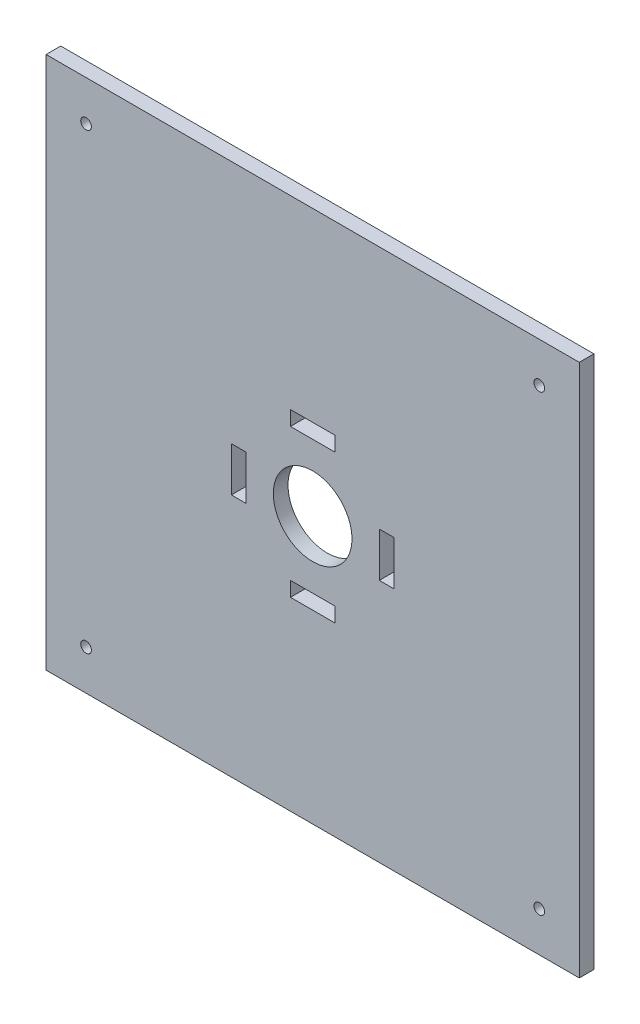
ISO-10303-21;
HEADER;
FILE_DESCRIPTION(('STEP AP214'),'2;1');
FILE_NAME('part.step','',(''),(''),'','','');
FILE_SCHEMA(('AUTOMOTIVE_DESIGN { 1 0 10303 214 1 1 1 1 }'));
ENDSEC;
DATA;
#1=APPLICATION_CONTEXT('core data for automotive mechanical design processes');
#2=APPLICATION_PROTOCOL_DEFINITION('international standard','automotive_design',2000,#1);
#3=PRODUCT_CONTEXT('',#1,'mechanical');
#4=PRODUCT('Part','Part','',(#3));
#5=PRODUCT_RELATED_PRODUCT_CATEGORY('part','',(#4));
#6=PRODUCT_DEFINITION_FORMATION('','',#4);
#7=PRODUCT_DEFINITION_CONTEXT('part definition',#1,'design');
#8=PRODUCT_DEFINITION('design','',#6,#7);
#9=PRODUCT_DEFINITION_SHAPE('','',#8);
#10=(LENGTH_UNIT() NAMED_UNIT(*) SI_UNIT(.MILLI.,.METRE.));
#11=(NAMED_UNIT(*) PLANE_ANGLE_UNIT() SI_UNIT($,.RADIAN.));
#12=(NAMED_UNIT(*) SI_UNIT($,.STERADIAN.) SOLID_ANGLE_UNIT());
#13=UNCERTAINTY_MEASURE_WITH_UNIT(LENGTH_MEASURE(1.E-05),#10,'distance_accuracy_value','');
#14=(GEOMETRIC_REPRESENTATION_CONTEXT(3) GLOBAL_UNCERTAINTY_ASSIGNED_CONTEXT((#13)) GLOBAL_UNIT_ASSIGNED_CONTEXT((#10,
#11,#12)) REPRESENTATION_CONTEXT('',''));
#15=CARTESIAN_POINT('',(0.,0.,0.));
#16=DIRECTION('',(0.,0.,1.));
#17=DIRECTION('',(1.,0.,0.));
#18=AXIS2_PLACEMENT_3D('',#15,#16,#17);
#19=CARTESIAN_POINT('',(0.,200.,5.5));
#20=DIRECTION('',(0.,0.,-1.));
#21=DIRECTION('',(-1.,0.,0.));
#22=AXIS2_PLACEMENT_3D('',#19,#20,#21);
#23=PLANE('',#22);
#24=DIRECTION('',(0.,-1.,0.));
#25=VECTOR('',#24,1.);
#26=CARTESIAN_POINT('',(69.5,91.6666666666667,5.5));
#27=LINE('',#26,#25);
#28=CARTESIAN_POINT('',(69.5,108.333333333333,5.49999999999999));
#29=VERTEX_POINT('',#28);
#30=CARTESIAN_POINT('',(69.5,91.6666666666667,5.5));
#31=VERTEX_POINT('',#30);
#32=EDGE_CURVE('E238',#29,#31,#27,.T.);
#33=ORIENTED_EDGE('',*,*,#32,.F.);
#34=DIRECTION('',(-1.,0.,0.));
#35=VECTOR('',#34,1.);
#36=CARTESIAN_POINT('',(75.,108.333333333333,5.49999999999999));
#37=LINE('',#36,#35);
#38=CARTESIAN_POINT('',(75.,108.333333333333,5.49999999999999));
#39=VERTEX_POINT('',#38);
#40=EDGE_CURVE('E246',#39,#29,#37,.T.);
#41=ORIENTED_EDGE('',*,*,#40,.F.);
#42=DIRECTION('',(0.,-1.,0.));
#43=VECTOR('',#42,1.);
#44=CARTESIAN_POINT('',(75.,91.6666666666667,5.5));
#45=LINE('',#44,#43);
#46=CARTESIAN_POINT('',(75.,91.6666666666667,5.5));
#47=VERTEX_POINT('',#46);
#48=EDGE_CURVE('E231',#39,#47,#45,.T.);
#49=ORIENTED_EDGE('',*,*,#48,.T.);
#50=DIRECTION('',(-1.,0.,0.));
#51=VECTOR('',#50,1.);
#52=CARTESIAN_POINT('',(75.,91.6666666666667,5.5));
#53=LINE('',#52,#51);
#54=EDGE_CURVE('E243',#47,#31,#53,.T.);
#55=ORIENTED_EDGE('',*,*,#54,.T.);
#56=EDGE_LOOP('',(#33,#41,#49,#55));
#57=FACE_BOUND('',#56,.T.);
#58=DIRECTION('',(-1.,0.,0.));
#59=VECTOR('',#58,1.);
#60=CARTESIAN_POINT('',(91.6666666666667,130.5,5.50000000000001));
#61=LINE('',#60,#59);
#62=CARTESIAN_POINT('',(108.333333333333,130.5,5.50000000000001));
#63=VERTEX_POINT('',#62);
#64=CARTESIAN_POINT('',(91.6666666666667,130.5,5.50000000000001));
#65=VERTEX_POINT('',#64);
#66=EDGE_CURVE('E194',#63,#65,#61,.T.);
#67=ORIENTED_EDGE('',*,*,#66,.F.);
#68=DIRECTION('',(0.,1.,0.));
#69=VECTOR('',#68,1.);
#70=CARTESIAN_POINT('',(108.333333333333,125.,5.50000000000001));
#71=LINE('',#70,#69);
#72=CARTESIAN_POINT('',(108.333333333333,125.,5.50000000000001));
#73=VERTEX_POINT('',#72);
#74=EDGE_CURVE('E176',#73,#63,#71,.T.);
#75=ORIENTED_EDGE('',*,*,#74,.F.);
#76=DIRECTION('',(-1.,0.,0.));
#77=VECTOR('',#76,1.);
#78=CARTESIAN_POINT('',(91.6666666666667,125.,5.50000000000001));
#79=LINE('',#78,#77);
#80=CARTESIAN_POINT('',(91.6666666666667,125.,5.5));
#81=VERTEX_POINT('',#80);
#82=EDGE_CURVE('E182',#73,#81,#79,.T.);
#83=ORIENTED_EDGE('',*,*,#82,.T.);
#84=DIRECTION('',(0.,1.,0.));
#85=VECTOR('',#84,1.);
#86=CARTESIAN_POINT('',(91.6666666666667,125.,5.50000000000001));
#87=LINE('',#86,#85);
#88=EDGE_CURVE('E195',#81,#65,#87,.T.);
#89=ORIENTED_EDGE('',*,*,#88,.T.);
#90=EDGE_LOOP('',(#67,#75,#83,#89));
#91=FACE_BOUND('',#90,.T.);
#92=CARTESIAN_POINT('',(14.9999999999991,184.999999999999,5.5));
#93=DIRECTION('',(0.,0.,-1.));
#94=DIRECTION('',(-1.,0.,0.));
#95=AXIS2_PLACEMENT_3D('',#92,#93,#94);
#96=CIRCLE('',#95,2.00000000000002);
#97=CARTESIAN_POINT('',(12.9999999999991,184.999999999999,5.5));
#98=VERTEX_POINT('',#97);
#99=EDGE_CURVE('E277',#98,#98,#96,.T.);
#100=ORIENTED_EDGE('',*,*,#99,.T.);
#101=EDGE_LOOP('',(#100));
#102=FACE_BOUND('',#101,.T.);
#103=CARTESIAN_POINT('',(184.999999999999,185.000000000001,5.5));
#104=DIRECTION('',(0.,0.,-1.));
#105=DIRECTION('',(-1.,0.,0.));
#106=AXIS2_PLACEMENT_3D('',#103,#104,#105);
#107=CIRCLE('',#106,2.00000000000002);
#108=CARTESIAN_POINT('',(182.999999999999,185.000000000001,5.5));
#109=VERTEX_POINT('',#108);
#110=EDGE_CURVE('E283',#109,#109,#107,.T.);
#111=ORIENTED_EDGE('',*,*,#110,.T.);
#112=EDGE_LOOP('',(#111));
#113=FACE_BOUND('',#112,.T.);
#114=CARTESIAN_POINT('',(185.,15.0000000000003,5.5));
#115=DIRECTION('',(0.,0.,-1.));
#116=DIRECTION('',(-1.,0.,0.));
#117=AXIS2_PLACEMENT_3D('',#114,#115,#116);
#118=CIRCLE('',#117,2.);
#119=CARTESIAN_POINT('',(183.,15.0000000000003,5.5));
#120=VERTEX_POINT('',#119);
#121=EDGE_CURVE('E289',#120,#120,#118,.T.);
#122=ORIENTED_EDGE('',*,*,#121,.T.);
#123=EDGE_LOOP('',(#122));
#124=FACE_BOUND('',#123,.T.);
#125=CARTESIAN_POINT('',(15.,15.,5.5));
#126=DIRECTION('',(0.,0.,-1.));
#127=DIRECTION('',(-1.,0.,0.));
#128=AXIS2_PLACEMENT_3D('',#125,#126,#127);
#129=CIRCLE('',#128,2.);
#130=CARTESIAN_POINT('',(13.,15.,5.5));
#131=VERTEX_POINT('',#130);
#132=EDGE_CURVE('E295',#131,#131,#129,.T.);
#133=ORIENTED_EDGE('',*,*,#132,.T.);
#134=EDGE_LOOP('',(#133));
#135=FACE_BOUND('',#134,.T.);
#136=DIRECTION('',(0.,-1.,0.));
#137=VECTOR('',#136,1.);
#138=CARTESIAN_POINT('',(0.,0.,5.5));
#139=LINE('',#138,#137);
#140=CARTESIAN_POINT('',(0.,200.,5.5));
#141=VERTEX_POINT('',#140);
#142=CARTESIAN_POINT('',(0.,0.,5.5));
#143=VERTEX_POINT('',#142);
#144=EDGE_CURVE('E301',#141,#143,#139,.T.);
#145=ORIENTED_EDGE('',*,*,#144,.T.);
#146=DIRECTION('',(1.,0.,0.));
#147=VECTOR('',#146,1.);
#148=CARTESIAN_POINT('',(0.,0.,5.5));
#149=LINE('',#148,#147);
#150=CARTESIAN_POINT('',(200.,0.,5.5));
#151=VERTEX_POINT('',#150);
#152=EDGE_CURVE('E304',#143,#151,#149,.T.);
#153=ORIENTED_EDGE('',*,*,#152,.T.);
#154=DIRECTION('',(0.,1.,0.));
#155=VECTOR('',#154,1.);
#156=CARTESIAN_POINT('',(200.,0.,5.5));
#157=LINE('',#156,#155);
#158=CARTESIAN_POINT('',(200.,200.,5.5));
#159=VERTEX_POINT('',#158);
#160=EDGE_CURVE('E307',#151,#159,#157,.T.);
#161=ORIENTED_EDGE('',*,*,#160,.T.);
#162=DIRECTION('',(-1.,0.,0.));
#163=VECTOR('',#162,1.);
#164=CARTESIAN_POINT('',(0.,200.,5.5));
#165=LINE('',#164,#163);
#166=EDGE_CURVE('E309',#159,#141,#165,.T.);
#167=ORIENTED_EDGE('',*,*,#166,.T.);
#168=EDGE_LOOP('',(#145,#153,#161,#167));
#169=FACE_BOUND('',#168,.T.);
#170=DIRECTION('',(0.,1.,0.));
#171=VECTOR('',#170,1.);
#172=CARTESIAN_POINT('',(130.5,108.333333333333,5.50000000000002));
#173=LINE('',#172,#171);
#174=CARTESIAN_POINT('',(130.5,91.6666666666667,5.50000000000002));
#175=VERTEX_POINT('',#174);
#176=CARTESIAN_POINT('',(130.5,108.333333333333,5.50000000000002));
#177=VERTEX_POINT('',#176);
#178=EDGE_CURVE('E214',#175,#177,#173,.T.);
#179=ORIENTED_EDGE('',*,*,#178,.F.);
#180=DIRECTION('',(1.,0.,0.));
#181=VECTOR('',#180,1.);
#182=CARTESIAN_POINT('',(125.,91.6666666666667,5.50000000000002));
#183=LINE('',#182,#181);
#184=CARTESIAN_POINT('',(125.,91.6666666666667,5.50000000000002));
#185=VERTEX_POINT('',#184);
#186=EDGE_CURVE('E222',#185,#175,#183,.T.);
#187=ORIENTED_EDGE('',*,*,#186,.F.);
#188=DIRECTION('',(0.,1.,0.));
#189=VECTOR('',#188,1.);
#190=CARTESIAN_POINT('',(125.,108.333333333333,5.50000000000002));
#191=LINE('',#190,#189);
#192=CARTESIAN_POINT('',(125.,108.333333333333,5.5));
#193=VERTEX_POINT('',#192);
#194=EDGE_CURVE('E205',#185,#193,#191,.T.);
#195=ORIENTED_EDGE('',*,*,#194,.T.);
#196=DIRECTION('',(1.,0.,0.));
#197=VECTOR('',#196,1.);
#198=CARTESIAN_POINT('',(125.,108.333333333333,5.50000000000002));
#199=LINE('',#198,#197);
#200=EDGE_CURVE('E219',#193,#177,#199,.T.);
#201=ORIENTED_EDGE('',*,*,#200,.T.);
#202=EDGE_LOOP('',(#179,#187,#195,#201));
#203=FACE_BOUND('',#202,.T.);
#204=DIRECTION('',(0.,-1.,0.));
#205=VECTOR('',#204,1.);
#206=CARTESIAN_POINT('',(91.6666666666667,75.,5.50000000000001));
#207=LINE('',#206,#205);
#208=CARTESIAN_POINT('',(91.6666666666667,75.,5.50000000000001));
#209=VERTEX_POINT('',#208);
#210=CARTESIAN_POINT('',(91.6666666666667,69.5,5.5));
#211=VERTEX_POINT('',#210);
#212=EDGE_CURVE('E47',#209,#211,#207,.T.);
#213=ORIENTED_EDGE('',*,*,#212,.F.);
#214=DIRECTION('',(1.,0.,0.));
#215=VECTOR('',#214,1.);
#216=CARTESIAN_POINT('',(108.333333333333,75.,5.50000000000001));
#217=LINE('',#216,#215);
#218=CARTESIAN_POINT('',(108.333333333333,75.,5.50000000000001));
#219=VERTEX_POINT('',#218);
#220=EDGE_CURVE('E255',#209,#219,#217,.T.);
#221=ORIENTED_EDGE('',*,*,#220,.T.);
#222=DIRECTION('',(0.,-1.,0.));
#223=VECTOR('',#222,1.);
#224=CARTESIAN_POINT('',(108.333333333333,75.,5.50000000000001));
#225=LINE('',#224,#223);
#226=CARTESIAN_POINT('',(108.333333333333,69.5,5.50000000000001));
#227=VERTEX_POINT('',#226);
#228=EDGE_CURVE('E269',#219,#227,#225,.T.);
#229=ORIENTED_EDGE('',*,*,#228,.T.);
#230=DIRECTION('',(1.,0.,0.));
#231=VECTOR('',#230,1.);
#232=CARTESIAN_POINT('',(108.333333333333,69.5,5.50000000000001));
#233=LINE('',#232,#231);
#234=EDGE_CURVE('E264',#211,#227,#233,.T.);
#235=ORIENTED_EDGE('',*,*,#234,.F.);
#236=EDGE_LOOP('',(#213,#221,#229,#235));
#237=FACE_BOUND('',#236,.T.);
#238=CARTESIAN_POINT('',(100.,100.,5.50000000000001));
#239=DIRECTION('',(0.,0.,1.));
#240=DIRECTION('',(1.,0.,0.));
#241=AXIS2_PLACEMENT_3D('',#238,#239,#240);
#242=CIRCLE('',#241,14.75);
#243=CARTESIAN_POINT('',(85.25,100.,5.50000000000001));
#244=VERTEX_POINT('',#243);
#245=EDGE_CURVE('E654',#244,#244,#242,.T.);
#246=ORIENTED_EDGE('',*,*,#245,.F.);
#247=EDGE_LOOP('',(#246));
#248=FACE_BOUND('',#247,.T.);
#249=ADVANCED_FACE('F31',(#57,#91,#102,#113,#124,#135,#169,#203,#237,#248),#23,.F.);
#250=CARTESIAN_POINT('',(0.,200.,0.));
#251=DIRECTION('',(0.,0.,-1.));
#252=DIRECTION('',(-1.,0.,0.));
#253=AXIS2_PLACEMENT_3D('',#250,#251,#252);
#254=PLANE('',#253);
#255=CARTESIAN_POINT('',(14.9999999999991,184.999999999999,0.));
#256=DIRECTION('',(0.,0.,-1.));
#257=DIRECTION('',(-1.,0.,0.));
#258=AXIS2_PLACEMENT_3D('',#255,#256,#257);
#259=CIRCLE('',#258,2.00000000000002);
#260=CARTESIAN_POINT('',(12.9999999999991,184.999999999999,0.));
#261=VERTEX_POINT('',#260);
#262=EDGE_CURVE('E276',#261,#261,#259,.T.);
#263=ORIENTED_EDGE('',*,*,#262,.F.);
#264=EDGE_LOOP('',(#263));
#265=FACE_BOUND('',#264,.T.);
#266=CARTESIAN_POINT('',(184.999999999999,185.000000000001,0.));
#267=DIRECTION('',(0.,0.,-1.));
#268=DIRECTION('',(-1.,0.,0.));
#269=AXIS2_PLACEMENT_3D('',#266,#267,#268);
#270=CIRCLE('',#269,2.00000000000002);
#271=CARTESIAN_POINT('',(182.999999999999,185.000000000001,0.));
#272=VERTEX_POINT('',#271);
#273=EDGE_CURVE('E280',#272,#272,#270,.T.);
#274=ORIENTED_EDGE('',*,*,#273,.F.);
#275=EDGE_LOOP('',(#274));
#276=FACE_BOUND('',#275,.T.);
#277=CARTESIAN_POINT('',(185.,15.0000000000003,0.));
#278=DIRECTION('',(0.,0.,-1.));
#279=DIRECTION('',(-1.,0.,0.));
#280=AXIS2_PLACEMENT_3D('',#277,#278,#279);
#281=CIRCLE('',#280,2.);
#282=CARTESIAN_POINT('',(183.,15.0000000000003,0.));
#283=VERTEX_POINT('',#282);
#284=EDGE_CURVE('E286',#283,#283,#281,.T.);
#285=ORIENTED_EDGE('',*,*,#284,.F.);
#286=EDGE_LOOP('',(#285));
#287=FACE_BOUND('',#286,.T.);
#288=CARTESIAN_POINT('',(15.,15.,0.));
#289=DIRECTION('',(0.,0.,-1.));
#290=DIRECTION('',(-1.,0.,0.));
#291=AXIS2_PLACEMENT_3D('',#288,#289,#290);
#292=CIRCLE('',#291,2.);
#293=CARTESIAN_POINT('',(13.,15.,0.));
#294=VERTEX_POINT('',#293);
#295=EDGE_CURVE('E292',#294,#294,#292,.T.);
#296=ORIENTED_EDGE('',*,*,#295,.F.);
#297=EDGE_LOOP('',(#296));
#298=FACE_BOUND('',#297,.T.);
#299=DIRECTION('',(0.,-1.,0.));
#300=VECTOR('',#299,1.);
#301=CARTESIAN_POINT('',(0.,0.,0.));
#302=LINE('',#301,#300);
#303=CARTESIAN_POINT('',(0.,200.,0.));
#304=VERTEX_POINT('',#303);
#305=CARTESIAN_POINT('',(0.,0.,0.));
#306=VERTEX_POINT('',#305);
#307=EDGE_CURVE('E298',#304,#306,#302,.T.);
#308=ORIENTED_EDGE('',*,*,#307,.F.);
#309=DIRECTION('',(-1.,0.,0.));
#310=VECTOR('',#309,1.);
#311=CARTESIAN_POINT('',(0.,200.,0.));
#312=LINE('',#311,#310);
#313=CARTESIAN_POINT('',(200.,200.,0.));
#314=VERTEX_POINT('',#313);
#315=EDGE_CURVE('E305',#314,#304,#312,.T.);
#316=ORIENTED_EDGE('',*,*,#315,.F.);
#317=DIRECTION('',(0.,1.,0.));
#318=VECTOR('',#317,1.);
#319=CARTESIAN_POINT('',(200.,0.,0.));
#320=LINE('',#319,#318);
#321=CARTESIAN_POINT('',(200.,0.,0.));
#322=VERTEX_POINT('',#321);
#323=EDGE_CURVE('E316',#322,#314,#320,.T.);
#324=ORIENTED_EDGE('',*,*,#323,.F.);
#325=DIRECTION('',(1.,0.,0.));
#326=VECTOR('',#325,1.);
#327=CARTESIAN_POINT('',(0.,0.,0.));
#328=LINE('',#327,#326);
#329=EDGE_CURVE('E314',#306,#322,#328,.T.);
#330=ORIENTED_EDGE('',*,*,#329,.F.);
#331=EDGE_LOOP('',(#308,#316,#324,#330));
#332=FACE_BOUND('',#331,.T.);
#333=DIRECTION('',(0.,1.,0.));
#334=VECTOR('',#333,1.);
#335=CARTESIAN_POINT('',(108.333333333333,125.,0.));
#336=LINE('',#335,#334);
#337=CARTESIAN_POINT('',(108.333333333333,125.,0.));
#338=VERTEX_POINT('',#337);
#339=CARTESIAN_POINT('',(108.333333333333,130.5,0.));
#340=VERTEX_POINT('',#339);
#341=EDGE_CURVE('E179',#338,#340,#336,.T.);
#342=ORIENTED_EDGE('',*,*,#341,.T.);
#343=DIRECTION('',(-1.,0.,0.));
#344=VECTOR('',#343,1.);
#345=CARTESIAN_POINT('',(0.,130.5,0.));
#346=LINE('',#345,#344);
#347=CARTESIAN_POINT('',(91.6666666666667,130.5,0.));
#348=VERTEX_POINT('',#347);
#349=EDGE_CURVE('E337',#340,#348,#346,.T.);
#350=ORIENTED_EDGE('',*,*,#349,.T.);
#351=DIRECTION('',(0.,1.,0.));
#352=VECTOR('',#351,1.);
#353=CARTESIAN_POINT('',(91.6666666666667,125.,0.));
#354=LINE('',#353,#352);
#355=CARTESIAN_POINT('',(91.6666666666667,125.,0.));
#356=VERTEX_POINT('',#355);
#357=EDGE_CURVE('E199',#356,#348,#354,.T.);
#358=ORIENTED_EDGE('',*,*,#357,.F.);
#359=DIRECTION('',(-1.,0.,0.));
#360=VECTOR('',#359,1.);
#361=CARTESIAN_POINT('',(0.,125.,0.));
#362=LINE('',#361,#360);
#363=EDGE_CURVE('E330',#338,#356,#362,.T.);
#364=ORIENTED_EDGE('',*,*,#363,.F.);
#365=EDGE_LOOP('',(#342,#350,#358,#364));
#366=FACE_BOUND('',#365,.T.);
#367=DIRECTION('',(1.,0.,0.));
#368=VECTOR('',#367,1.);
#369=CARTESIAN_POINT('',(0.,75.,0.));
#370=LINE('',#369,#368);
#371=CARTESIAN_POINT('',(91.6666666666667,75.,0.));
#372=VERTEX_POINT('',#371);
#373=CARTESIAN_POINT('',(108.333333333333,75.,0.));
#374=VERTEX_POINT('',#373);
#375=EDGE_CURVE('E334',#372,#374,#370,.T.);
#376=ORIENTED_EDGE('',*,*,#375,.F.);
#377=DIRECTION('',(0.,-1.,0.));
#378=VECTOR('',#377,1.);
#379=CARTESIAN_POINT('',(91.6666666666667,75.,0.));
#380=LINE('',#379,#378);
#381=CARTESIAN_POINT('',(91.6666666666667,69.5,0.));
#382=VERTEX_POINT('',#381);
#383=EDGE_CURVE('E273',#372,#382,#380,.T.);
#384=ORIENTED_EDGE('',*,*,#383,.T.);
#385=DIRECTION('',(1.,0.,0.));
#386=VECTOR('',#385,1.);
#387=CARTESIAN_POINT('',(0.,69.5,0.));
#388=LINE('',#387,#386);
#389=CARTESIAN_POINT('',(108.333333333333,69.5,0.));
#390=VERTEX_POINT('',#389);
#391=EDGE_CURVE('E11',#382,#390,#388,.T.);
#392=ORIENTED_EDGE('',*,*,#391,.T.);
#393=DIRECTION('',(0.,-1.,0.));
#394=VECTOR('',#393,1.);
#395=CARTESIAN_POINT('',(108.333333333333,75.,0.));
#396=LINE('',#395,#394);
#397=EDGE_CURVE('E262',#374,#390,#396,.T.);
#398=ORIENTED_EDGE('',*,*,#397,.F.);
#399=EDGE_LOOP('',(#376,#384,#392,#398));
#400=FACE_BOUND('',#399,.T.);
#401=DIRECTION('',(-1.,0.,0.));
#402=VECTOR('',#401,1.);
#403=CARTESIAN_POINT('',(75.,108.333333333333,0.));
#404=LINE('',#403,#402);
#405=CARTESIAN_POINT('',(75.,108.333333333333,0.));
#406=VERTEX_POINT('',#405);
#407=CARTESIAN_POINT('',(69.5,108.333333333333,0.));
#408=VERTEX_POINT('',#407);
#409=EDGE_CURVE('E249',#406,#408,#404,.T.);
#410=ORIENTED_EDGE('',*,*,#409,.T.);
#411=DIRECTION('',(0.,-1.,0.));
#412=VECTOR('',#411,1.);
#413=CARTESIAN_POINT('',(69.5,200.,0.));
#414=LINE('',#413,#412);
#415=CARTESIAN_POINT('',(69.5,91.6666666666667,0.));
#416=VERTEX_POINT('',#415);
#417=EDGE_CURVE('E338',#408,#416,#414,.T.);
#418=ORIENTED_EDGE('',*,*,#417,.T.);
#419=DIRECTION('',(-1.,0.,0.));
#420=VECTOR('',#419,1.);
#421=CARTESIAN_POINT('',(75.,91.6666666666667,0.));
#422=LINE('',#421,#420);
#423=CARTESIAN_POINT('',(75.,91.6666666666667,0.));
#424=VERTEX_POINT('',#423);
#425=EDGE_CURVE('E236',#424,#416,#422,.T.);
#426=ORIENTED_EDGE('',*,*,#425,.F.);
#427=DIRECTION('',(0.,-1.,0.));
#428=VECTOR('',#427,1.);
#429=CARTESIAN_POINT('',(75.,200.,0.));
#430=LINE('',#429,#428);
#431=EDGE_CURVE('E335',#406,#424,#430,.T.);
#432=ORIENTED_EDGE('',*,*,#431,.F.);
#433=EDGE_LOOP('',(#410,#418,#426,#432));
#434=FACE_BOUND('',#433,.T.);
#435=DIRECTION('',(1.,0.,0.));
#436=VECTOR('',#435,1.);
#437=CARTESIAN_POINT('',(125.,91.6666666666667,0.));
#438=LINE('',#437,#436);
#439=CARTESIAN_POINT('',(125.,91.6666666666667,0.));
#440=VERTEX_POINT('',#439);
#441=CARTESIAN_POINT('',(130.5,91.6666666666667,0.));
#442=VERTEX_POINT('',#441);
#443=EDGE_CURVE('E225',#440,#442,#438,.T.);
#444=ORIENTED_EDGE('',*,*,#443,.T.);
#445=DIRECTION('',(0.,1.,0.));
#446=VECTOR('',#445,1.);
#447=CARTESIAN_POINT('',(130.5,200.,0.));
#448=LINE('',#447,#446);
#449=CARTESIAN_POINT('',(130.5,108.333333333333,0.));
#450=VERTEX_POINT('',#449);
#451=EDGE_CURVE('E40',#442,#450,#448,.T.);
#452=ORIENTED_EDGE('',*,*,#451,.T.);
#453=DIRECTION('',(1.,0.,0.));
#454=VECTOR('',#453,1.);
#455=CARTESIAN_POINT('',(125.,108.333333333333,0.));
#456=LINE('',#455,#454);
#457=CARTESIAN_POINT('',(125.,108.333333333333,0.));
#458=VERTEX_POINT('',#457);
#459=EDGE_CURVE('E212',#458,#450,#456,.T.);
#460=ORIENTED_EDGE('',*,*,#459,.F.);
#461=DIRECTION('',(0.,1.,0.));
#462=VECTOR('',#461,1.);
#463=CARTESIAN_POINT('',(125.,200.,0.));
#464=LINE('',#463,#462);
#465=EDGE_CURVE('E332',#440,#458,#464,.T.);
#466=ORIENTED_EDGE('',*,*,#465,.F.);
#467=EDGE_LOOP('',(#444,#452,#460,#466));
#468=FACE_BOUND('',#467,.T.);
#469=CARTESIAN_POINT('',(100.,100.,0.));
#470=DIRECTION('',(0.,0.,-1.));
#471=DIRECTION('',(-1.,0.,0.));
#472=AXIS2_PLACEMENT_3D('',#469,#470,#471);
#473=CIRCLE('',#472,14.75);
#474=CARTESIAN_POINT('',(85.25,100.,0.));
#475=VERTEX_POINT('',#474);
#476=EDGE_CURVE('E35',#475,#475,#473,.F.);
#477=ORIENTED_EDGE('',*,*,#476,.T.);
#478=EDGE_LOOP('',(#477));
#479=FACE_BOUND('',#478,.T.);
#480=ADVANCED_FACE('F347',(#265,#276,#287,#298,#332,#366,#400,#434,#468,#479),#254,.T.);
#481=CARTESIAN_POINT('',(0.,0.,5.5));
#482=DIRECTION('',(1.,0.,0.));
#483=DIRECTION('',(0.,0.,-1.));
#484=AXIS2_PLACEMENT_3D('',#481,#482,#483);
#485=PLANE('',#484);
#486=ORIENTED_EDGE('',*,*,#307,.T.);
#487=DIRECTION('',(0.,0.,-1.));
#488=VECTOR('',#487,1.);
#489=CARTESIAN_POINT('',(0.,0.,5.5));
#490=LINE('',#489,#488);
#491=EDGE_CURVE('E327',#143,#306,#490,.T.);
#492=ORIENTED_EDGE('',*,*,#491,.F.);
#493=ORIENTED_EDGE('',*,*,#144,.F.);
#494=DIRECTION('',(0.,0.,-1.));
#495=VECTOR('',#494,1.);
#496=CARTESIAN_POINT('',(0.,200.,5.5));
#497=LINE('',#496,#495);
#498=EDGE_CURVE('E311',#141,#304,#497,.T.);
#499=ORIENTED_EDGE('',*,*,#498,.T.);
#500=EDGE_LOOP('',(#486,#492,#493,#499));
#501=FACE_BOUND('',#500,.T.);
#502=ADVANCED_FACE('F33',(#501),#485,.F.);
#503=CARTESIAN_POINT('',(0.,0.,5.5));
#504=DIRECTION('',(0.,1.,0.));
#505=DIRECTION('',(0.,0.,1.));
#506=AXIS2_PLACEMENT_3D('',#503,#504,#505);
#507=PLANE('',#506);
#508=ORIENTED_EDGE('',*,*,#329,.T.);
#509=DIRECTION('',(0.,0.,-1.));
#510=VECTOR('',#509,1.);
#511=CARTESIAN_POINT('',(200.,0.,5.5));
#512=LINE('',#511,#510);
#513=EDGE_CURVE('E324',#151,#322,#512,.T.);
#514=ORIENTED_EDGE('',*,*,#513,.F.);
#515=ORIENTED_EDGE('',*,*,#152,.F.);
#516=ORIENTED_EDGE('',*,*,#491,.T.);
#517=EDGE_LOOP('',(#508,#514,#515,#516));
#518=FACE_BOUND('',#517,.T.);
#519=ADVANCED_FACE('F397',(#518),#507,.F.);
#520=CARTESIAN_POINT('',(200.,0.,5.5));
#521=DIRECTION('',(-1.,0.,0.));
#522=DIRECTION('',(0.,0.,1.));
#523=AXIS2_PLACEMENT_3D('',#520,#521,#522);
#524=PLANE('',#523);
#525=ORIENTED_EDGE('',*,*,#323,.T.);
#526=DIRECTION('',(0.,0.,-1.));
#527=VECTOR('',#526,1.);
#528=CARTESIAN_POINT('',(200.,200.,5.5));
#529=LINE('',#528,#527);
#530=EDGE_CURVE('E321',#159,#314,#529,.T.);
#531=ORIENTED_EDGE('',*,*,#530,.F.);
#532=ORIENTED_EDGE('',*,*,#160,.F.);
#533=ORIENTED_EDGE('',*,*,#513,.T.);
#534=EDGE_LOOP('',(#525,#531,#532,#533));
#535=FACE_BOUND('',#534,.T.);
#536=ADVANCED_FACE('F394',(#535),#524,.F.);
#537=CARTESIAN_POINT('',(0.,200.,5.5));
#538=DIRECTION('',(0.,-1.,0.));
#539=DIRECTION('',(0.,0.,-1.));
#540=AXIS2_PLACEMENT_3D('',#537,#538,#539);
#541=PLANE('',#540);
#542=ORIENTED_EDGE('',*,*,#315,.T.);
#543=ORIENTED_EDGE('',*,*,#498,.F.);
#544=ORIENTED_EDGE('',*,*,#166,.F.);
#545=ORIENTED_EDGE('',*,*,#530,.T.);
#546=EDGE_LOOP('',(#542,#543,#544,#545));
#547=FACE_BOUND('',#546,.T.);
#548=ADVANCED_FACE('F391',(#547),#541,.F.);
#549=CARTESIAN_POINT('',(15.,15.,5.5));
#550=DIRECTION('',(0.,0.,-1.));
#551=DIRECTION('',(-1.,0.,0.));
#552=AXIS2_PLACEMENT_3D('',#549,#550,#551);
#553=CYLINDRICAL_SURFACE('',#552,2.);
#554=ORIENTED_EDGE('',*,*,#132,.F.);
#555=EDGE_LOOP('',(#554));
#556=FACE_BOUND('',#555,.T.);
#557=ORIENTED_EDGE('',*,*,#295,.T.);
#558=EDGE_LOOP('',(#557));
#559=FACE_BOUND('',#558,.T.);
#560=ADVANCED_FACE('F388',(#556,#559),#553,.F.);
#561=CARTESIAN_POINT('',(185.,15.0000000000003,5.5));
#562=DIRECTION('',(0.,0.,-1.));
#563=DIRECTION('',(-1.,0.,0.));
#564=AXIS2_PLACEMENT_3D('',#561,#562,#563);
#565=CYLINDRICAL_SURFACE('',#564,2.);
#566=ORIENTED_EDGE('',*,*,#121,.F.);
#567=EDGE_LOOP('',(#566));
#568=FACE_BOUND('',#567,.T.);
#569=ORIENTED_EDGE('',*,*,#284,.T.);
#570=EDGE_LOOP('',(#569));
#571=FACE_BOUND('',#570,.T.);
#572=ADVANCED_FACE('F470',(#568,#571),#565,.F.);
#573=CARTESIAN_POINT('',(184.999999999999,185.000000000001,5.5));
#574=DIRECTION('',(0.,0.,-1.));
#575=DIRECTION('',(-1.,0.,0.));
#576=AXIS2_PLACEMENT_3D('',#573,#574,#575);
#577=CYLINDRICAL_SURFACE('',#576,2.00000000000002);
#578=ORIENTED_EDGE('',*,*,#110,.F.);
#579=EDGE_LOOP('',(#578));
#580=FACE_BOUND('',#579,.T.);
#581=ORIENTED_EDGE('',*,*,#273,.T.);
#582=EDGE_LOOP('',(#581));
#583=FACE_BOUND('',#582,.T.);
#584=ADVANCED_FACE('F467',(#580,#583),#577,.F.);
#585=CARTESIAN_POINT('',(14.9999999999991,184.999999999999,5.5));
#586=DIRECTION('',(0.,0.,-1.));
#587=DIRECTION('',(-1.,0.,0.));
#588=AXIS2_PLACEMENT_3D('',#585,#586,#587);
#589=CYLINDRICAL_SURFACE('',#588,2.00000000000002);
#590=ORIENTED_EDGE('',*,*,#99,.F.);
#591=EDGE_LOOP('',(#590));
#592=FACE_BOUND('',#591,.T.);
#593=ORIENTED_EDGE('',*,*,#262,.T.);
#594=EDGE_LOOP('',(#593));
#595=FACE_BOUND('',#594,.T.);
#596=ADVANCED_FACE('F464',(#592,#595),#589,.F.);
#597=CARTESIAN_POINT('',(125.,125.,0.));
#598=DIRECTION('',(0.,-1.,0.));
#599=DIRECTION('',(1.,0.,0.));
#600=AXIS2_PLACEMENT_3D('',#597,#598,#599);
#601=PLANE('',#600);
#602=ORIENTED_EDGE('',*,*,#363,.T.);
#603=DIRECTION('',(0.,0.,-1.));
#604=VECTOR('',#603,1.);
#605=CARTESIAN_POINT('',(91.6666666666667,125.,0.));
#606=LINE('',#605,#604);
#607=EDGE_CURVE('E188',#81,#356,#606,.T.);
#608=ORIENTED_EDGE('',*,*,#607,.F.);
#609=ORIENTED_EDGE('',*,*,#82,.F.);
#610=DIRECTION('',(0.,0.,1.));
#611=VECTOR('',#610,1.);
#612=CARTESIAN_POINT('',(108.333333333333,125.,0.));
#613=LINE('',#612,#611);
#614=EDGE_CURVE('E171',#338,#73,#613,.T.);
#615=ORIENTED_EDGE('',*,*,#614,.F.);
#616=EDGE_LOOP('',(#602,#608,#609,#615));
#617=FACE_BOUND('',#616,.T.);
#618=ADVANCED_FACE('F186',(#617),#601,.F.);
#619=CARTESIAN_POINT('',(91.6666666666667,125.,0.));
#620=DIRECTION('',(1.,0.,0.));
#621=DIRECTION('',(0.,1.,0.));
#622=AXIS2_PLACEMENT_3D('',#619,#620,#621);
#623=PLANE('',#622);
#624=DIRECTION('',(0.,0.,-1.));
#625=VECTOR('',#624,1.);
#626=CARTESIAN_POINT('',(91.6666666666667,130.5,0.));
#627=LINE('',#626,#625);
#628=EDGE_CURVE('E183',#65,#348,#627,.T.);
#629=ORIENTED_EDGE('',*,*,#628,.F.);
#630=ORIENTED_EDGE('',*,*,#88,.F.);
#631=ORIENTED_EDGE('',*,*,#607,.T.);
#632=ORIENTED_EDGE('',*,*,#357,.T.);
#633=EDGE_LOOP('',(#629,#630,#631,#632));
#634=FACE_BOUND('',#633,.T.);
#635=ADVANCED_FACE('F604',(#634),#623,.T.);
#636=CARTESIAN_POINT('',(108.333333333333,125.,0.));
#637=DIRECTION('',(-1.,0.,0.));
#638=DIRECTION('',(0.,0.,-1.));
#639=AXIS2_PLACEMENT_3D('',#636,#637,#638);
#640=PLANE('',#639);
#641=DIRECTION('',(0.,0.,1.));
#642=VECTOR('',#641,1.);
#643=CARTESIAN_POINT('',(108.333333333333,130.5,0.));
#644=LINE('',#643,#642);
#645=EDGE_CURVE('E649',#340,#63,#644,.T.);
#646=ORIENTED_EDGE('',*,*,#645,.F.);
#647=ORIENTED_EDGE('',*,*,#341,.F.);
#648=ORIENTED_EDGE('',*,*,#614,.T.);
#649=ORIENTED_EDGE('',*,*,#74,.T.);
#650=EDGE_LOOP('',(#646,#647,#648,#649));
#651=FACE_BOUND('',#650,.T.);
#652=ADVANCED_FACE('F174',(#651),#640,.T.);
#653=CARTESIAN_POINT('',(75.,130.5,-13.3333333333334));
#654=DIRECTION('',(0.,-1.,0.));
#655=DIRECTION('',(1.,0.,0.));
#656=AXIS2_PLACEMENT_3D('',#653,#654,#655);
#657=PLANE('',#656);
#658=ORIENTED_EDGE('',*,*,#645,.T.);
#659=ORIENTED_EDGE('',*,*,#66,.T.);
#660=ORIENTED_EDGE('',*,*,#628,.T.);
#661=ORIENTED_EDGE('',*,*,#349,.F.);
#662=EDGE_LOOP('',(#658,#659,#660,#661));
#663=FACE_BOUND('',#662,.T.);
#664=ADVANCED_FACE('F368',(#663),#657,.T.);
#665=CARTESIAN_POINT('',(125.,75.,0.));
#666=DIRECTION('',(-1.,0.,0.));
#667=DIRECTION('',(0.,-1.,0.));
#668=AXIS2_PLACEMENT_3D('',#665,#666,#667);
#669=PLANE('',#668);
#670=ORIENTED_EDGE('',*,*,#465,.T.);
#671=DIRECTION('',(0.,0.,-1.));
#672=VECTOR('',#671,1.);
#673=CARTESIAN_POINT('',(125.,108.333333333333,0.));
#674=LINE('',#673,#672);
#675=EDGE_CURVE('E209',#193,#458,#674,.T.);
#676=ORIENTED_EDGE('',*,*,#675,.F.);
#677=ORIENTED_EDGE('',*,*,#194,.F.);
#678=DIRECTION('',(0.,0.,1.));
#679=VECTOR('',#678,1.);
#680=CARTESIAN_POINT('',(125.,91.6666666666667,0.));
#681=LINE('',#680,#679);
#682=EDGE_CURVE('E203',#440,#185,#681,.T.);
#683=ORIENTED_EDGE('',*,*,#682,.F.);
#684=EDGE_LOOP('',(#670,#676,#677,#683));
#685=FACE_BOUND('',#684,.T.);
#686=ADVANCED_FACE('F366',(#685),#669,.F.);
#687=CARTESIAN_POINT('',(125.,108.333333333333,0.));
#688=DIRECTION('',(0.,-1.,0.));
#689=DIRECTION('',(1.,0.,0.));
#690=AXIS2_PLACEMENT_3D('',#687,#688,#689);
#691=PLANE('',#690);
#692=DIRECTION('',(0.,0.,-1.));
#693=VECTOR('',#692,1.);
#694=CARTESIAN_POINT('',(130.5,108.333333333333,0.));
#695=LINE('',#694,#693);
#696=EDGE_CURVE('E206',#177,#450,#695,.T.);
#697=ORIENTED_EDGE('',*,*,#696,.F.);
#698=ORIENTED_EDGE('',*,*,#200,.F.);
#699=ORIENTED_EDGE('',*,*,#675,.T.);
#700=ORIENTED_EDGE('',*,*,#459,.T.);
#701=EDGE_LOOP('',(#697,#698,#699,#700));
#702=FACE_BOUND('',#701,.T.);
#703=ADVANCED_FACE('F364',(#702),#691,.T.);
#704=CARTESIAN_POINT('',(125.,91.6666666666667,0.));
#705=DIRECTION('',(0.,1.,0.));
#706=DIRECTION('',(0.,0.,-1.));
#707=AXIS2_PLACEMENT_3D('',#704,#705,#706);
#708=PLANE('',#707);
#709=DIRECTION('',(0.,0.,1.));
#710=VECTOR('',#709,1.);
#711=CARTESIAN_POINT('',(130.5,91.6666666666667,0.));
#712=LINE('',#711,#710);
#713=EDGE_CURVE('E197',#442,#175,#712,.T.);
#714=ORIENTED_EDGE('',*,*,#713,.F.);
#715=ORIENTED_EDGE('',*,*,#443,.F.);
#716=ORIENTED_EDGE('',*,*,#682,.T.);
#717=ORIENTED_EDGE('',*,*,#186,.T.);
#718=EDGE_LOOP('',(#714,#715,#716,#717));
#719=FACE_BOUND('',#718,.T.);
#720=ADVANCED_FACE('F355',(#719),#708,.T.);
#721=CARTESIAN_POINT('',(130.5,75.,-26.6666666666667));
#722=DIRECTION('',(-1.,0.,0.));
#723=DIRECTION('',(0.,0.,1.));
#724=AXIS2_PLACEMENT_3D('',#721,#722,#723);
#725=PLANE('',#724);
#726=ORIENTED_EDGE('',*,*,#713,.T.);
#727=ORIENTED_EDGE('',*,*,#178,.T.);
#728=ORIENTED_EDGE('',*,*,#696,.T.);
#729=ORIENTED_EDGE('',*,*,#451,.F.);
#730=EDGE_LOOP('',(#726,#727,#728,#729));
#731=FACE_BOUND('',#730,.T.);
#732=ADVANCED_FACE('F352',(#731),#725,.T.);
#733=CARTESIAN_POINT('',(75.,125.,0.));
#734=DIRECTION('',(1.,0.,0.));
#735=DIRECTION('',(0.,1.,0.));
#736=AXIS2_PLACEMENT_3D('',#733,#734,#735);
#737=PLANE('',#736);
#738=ORIENTED_EDGE('',*,*,#431,.T.);
#739=DIRECTION('',(0.,0.,-1.));
#740=VECTOR('',#739,1.);
#741=CARTESIAN_POINT('',(75.,91.6666666666667,0.));
#742=LINE('',#741,#740);
#743=EDGE_CURVE('E55',#47,#424,#742,.T.);
#744=ORIENTED_EDGE('',*,*,#743,.F.);
#745=ORIENTED_EDGE('',*,*,#48,.F.);
#746=DIRECTION('',(0.,0.,1.));
#747=VECTOR('',#746,1.);
#748=CARTESIAN_POINT('',(75.,108.333333333333,0.));
#749=LINE('',#748,#747);
#750=EDGE_CURVE('E229',#406,#39,#749,.T.);
#751=ORIENTED_EDGE('',*,*,#750,.F.);
#752=EDGE_LOOP('',(#738,#744,#745,#751));
#753=FACE_BOUND('',#752,.T.);
#754=ADVANCED_FACE('F428',(#753),#737,.F.);
#755=CARTESIAN_POINT('',(75.,91.6666666666667,0.));
#756=DIRECTION('',(0.,1.,0.));
#757=DIRECTION('',(-1.,0.,0.));
#758=AXIS2_PLACEMENT_3D('',#755,#756,#757);
#759=PLANE('',#758);
#760=DIRECTION('',(0.,0.,-1.));
#761=VECTOR('',#760,1.);
#762=CARTESIAN_POINT('',(69.5,91.6666666666667,0.));
#763=LINE('',#762,#761);
#764=EDGE_CURVE('E232',#31,#416,#763,.T.);
#765=ORIENTED_EDGE('',*,*,#764,.F.);
#766=ORIENTED_EDGE('',*,*,#54,.F.);
#767=ORIENTED_EDGE('',*,*,#743,.T.);
#768=ORIENTED_EDGE('',*,*,#425,.T.);
#769=EDGE_LOOP('',(#765,#766,#767,#768));
#770=FACE_BOUND('',#769,.T.);
#771=ADVANCED_FACE('F434',(#770),#759,.T.);
#772=CARTESIAN_POINT('',(75.,108.333333333333,0.));
#773=DIRECTION('',(0.,-1.,0.));
#774=DIRECTION('',(0.,0.,-1.));
#775=AXIS2_PLACEMENT_3D('',#772,#773,#774);
#776=PLANE('',#775);
#777=DIRECTION('',(0.,0.,1.));
#778=VECTOR('',#777,1.);
#779=CARTESIAN_POINT('',(69.5,108.333333333333,0.));
#780=LINE('',#779,#778);
#781=EDGE_CURVE('E228',#408,#29,#780,.T.);
#782=ORIENTED_EDGE('',*,*,#781,.F.);
#783=ORIENTED_EDGE('',*,*,#409,.F.);
#784=ORIENTED_EDGE('',*,*,#750,.T.);
#785=ORIENTED_EDGE('',*,*,#40,.T.);
#786=EDGE_LOOP('',(#782,#783,#784,#785));
#787=FACE_BOUND('',#786,.T.);
#788=ADVANCED_FACE('F427',(#787),#776,.T.);
#789=CARTESIAN_POINT('',(69.5,75.,-13.3333333333333));
#790=DIRECTION('',(1.,0.,0.));
#791=DIRECTION('',(0.,1.,0.));
#792=AXIS2_PLACEMENT_3D('',#789,#790,#791);
#793=PLANE('',#792);
#794=ORIENTED_EDGE('',*,*,#781,.T.);
#795=ORIENTED_EDGE('',*,*,#32,.T.);
#796=ORIENTED_EDGE('',*,*,#764,.T.);
#797=ORIENTED_EDGE('',*,*,#417,.F.);
#798=EDGE_LOOP('',(#794,#795,#796,#797));
#799=FACE_BOUND('',#798,.T.);
#800=ADVANCED_FACE('F432',(#799),#793,.T.);
#801=CARTESIAN_POINT('',(91.6666666666667,75.,0.));
#802=DIRECTION('',(1.,0.,0.));
#803=DIRECTION('',(0.,0.,-1.));
#804=AXIS2_PLACEMENT_3D('',#801,#802,#803);
#805=PLANE('',#804);
#806=DIRECTION('',(0.,0.,1.));
#807=VECTOR('',#806,1.);
#808=CARTESIAN_POINT('',(91.6666666666667,69.5,0.));
#809=LINE('',#808,#807);
#810=EDGE_CURVE('E252',#382,#211,#809,.T.);
#811=ORIENTED_EDGE('',*,*,#810,.F.);
#812=ORIENTED_EDGE('',*,*,#383,.F.);
#813=DIRECTION('',(0.,0.,1.));
#814=VECTOR('',#813,1.);
#815=CARTESIAN_POINT('',(91.6666666666667,75.,0.));
#816=LINE('',#815,#814);
#817=EDGE_CURVE('E253',#372,#209,#816,.T.);
#818=ORIENTED_EDGE('',*,*,#817,.T.);
#819=ORIENTED_EDGE('',*,*,#212,.T.);
#820=EDGE_LOOP('',(#811,#812,#818,#819));
#821=FACE_BOUND('',#820,.T.);
#822=ADVANCED_FACE('F456',(#821),#805,.T.);
#823=CARTESIAN_POINT('',(108.333333333333,75.,0.));
#824=DIRECTION('',(-1.,0.,0.));
#825=DIRECTION('',(0.,-1.,0.));
#826=AXIS2_PLACEMENT_3D('',#823,#824,#825);
#827=PLANE('',#826);
#828=DIRECTION('',(0.,0.,-1.));
#829=VECTOR('',#828,1.);
#830=CARTESIAN_POINT('',(108.333333333333,69.5,0.));
#831=LINE('',#830,#829);
#832=EDGE_CURVE('E256',#227,#390,#831,.T.);
#833=ORIENTED_EDGE('',*,*,#832,.F.);
#834=ORIENTED_EDGE('',*,*,#228,.F.);
#835=DIRECTION('',(0.,0.,-1.));
#836=VECTOR('',#835,1.);
#837=CARTESIAN_POINT('',(108.333333333333,75.,0.));
#838=LINE('',#837,#836);
#839=EDGE_CURVE('E259',#219,#374,#838,.T.);
#840=ORIENTED_EDGE('',*,*,#839,.T.);
#841=ORIENTED_EDGE('',*,*,#397,.T.);
#842=EDGE_LOOP('',(#833,#834,#840,#841));
#843=FACE_BOUND('',#842,.T.);
#844=ADVANCED_FACE('F448',(#843),#827,.T.);
#845=CARTESIAN_POINT('',(75.,75.,0.));
#846=DIRECTION('',(0.,1.,0.));
#847=DIRECTION('',(-1.,0.,0.));
#848=AXIS2_PLACEMENT_3D('',#845,#846,#847);
#849=PLANE('',#848);
#850=ORIENTED_EDGE('',*,*,#375,.T.);
#851=ORIENTED_EDGE('',*,*,#839,.F.);
#852=ORIENTED_EDGE('',*,*,#220,.F.);
#853=ORIENTED_EDGE('',*,*,#817,.F.);
#854=EDGE_LOOP('',(#850,#851,#852,#853));
#855=FACE_BOUND('',#854,.T.);
#856=ADVANCED_FACE('F444',(#855),#849,.F.);
#857=CARTESIAN_POINT('',(75.,69.5,0.));
#858=DIRECTION('',(0.,1.,0.));
#859=DIRECTION('',(-1.,0.,0.));
#860=AXIS2_PLACEMENT_3D('',#857,#858,#859);
#861=PLANE('',#860);
#862=ORIENTED_EDGE('',*,*,#810,.T.);
#863=ORIENTED_EDGE('',*,*,#234,.T.);
#864=ORIENTED_EDGE('',*,*,#832,.T.);
#865=ORIENTED_EDGE('',*,*,#391,.F.);
#866=EDGE_LOOP('',(#862,#863,#864,#865));
#867=FACE_BOUND('',#866,.T.);
#868=ADVANCED_FACE('F447',(#867),#861,.T.);
#869=CARTESIAN_POINT('',(100.,100.,5.50000000000001));
#870=DIRECTION('',(0.,0.,-1.));
#871=DIRECTION('',(-1.,0.,0.));
#872=AXIS2_PLACEMENT_3D('',#869,#870,#871);
#873=CYLINDRICAL_SURFACE('',#872,14.75);
#874=CARTESIAN_POINT('',(85.25,100.,0.));
#875=CARTESIAN_POINT('',(85.25,100.,0.0572916666666676));
#876=CARTESIAN_POINT('',(85.25,100.,0.114583333333334));
#877=CARTESIAN_POINT('',(85.25,100.,0.229166666666668));
#878=CARTESIAN_POINT('',(85.25,100.,0.286458333333334));
#879=CARTESIAN_POINT('',(85.25,100.,0.401041666666668));
#880=CARTESIAN_POINT('',(85.25,100.,0.458333333333335));
#881=CARTESIAN_POINT('',(85.25,100.,0.572916666666668));
#882=CARTESIAN_POINT('',(85.25,100.,0.630208333333335));
#883=CARTESIAN_POINT('',(85.25,100.,0.744791666666668));
#884=CARTESIAN_POINT('',(85.25,100.,0.802083333333335));
#885=CARTESIAN_POINT('',(85.25,100.,0.916666666666668));
#886=CARTESIAN_POINT('',(85.25,100.,0.973958333333335));
#887=CARTESIAN_POINT('',(85.25,100.,1.08854166666667));
#888=CARTESIAN_POINT('',(85.25,100.,1.14583333333334));
#889=CARTESIAN_POINT('',(85.25,100.,1.26041666666667));
#890=CARTESIAN_POINT('',(85.25,100.,1.31770833333334));
#891=CARTESIAN_POINT('',(85.25,100.,1.43229166666667));
#892=CARTESIAN_POINT('',(85.25,100.,1.48958333333334));
#893=CARTESIAN_POINT('',(85.25,100.,1.60416666666667));
#894=CARTESIAN_POINT('',(85.25,100.,1.66145833333334));
#895=CARTESIAN_POINT('',(85.25,100.,1.77604166666667));
#896=CARTESIAN_POINT('',(85.25,100.,1.83333333333334));
#897=CARTESIAN_POINT('',(85.25,100.,1.94791666666667));
#898=CARTESIAN_POINT('',(85.25,100.,2.00520833333334));
#899=CARTESIAN_POINT('',(85.25,100.,2.11979166666667));
#900=CARTESIAN_POINT('',(85.25,100.,2.17708333333334));
#901=CARTESIAN_POINT('',(85.25,100.,2.29166666666667));
#902=CARTESIAN_POINT('',(85.25,100.,2.34895833333334));
#903=CARTESIAN_POINT('',(85.25,100.,2.46354166666667));
#904=CARTESIAN_POINT('',(85.25,100.,2.52083333333334));
#905=CARTESIAN_POINT('',(85.25,100.,2.63541666666667));
#906=CARTESIAN_POINT('',(85.25,100.,2.69270833333334));
#907=CARTESIAN_POINT('',(85.25,100.,2.80729166666667));
#908=CARTESIAN_POINT('',(85.25,100.,2.86458333333334));
#909=CARTESIAN_POINT('',(85.25,100.,2.97916666666667));
#910=CARTESIAN_POINT('',(85.25,100.,3.03645833333334));
#911=CARTESIAN_POINT('',(85.25,100.,3.15104166666667));
#912=CARTESIAN_POINT('',(85.25,100.,3.20833333333334));
#913=CARTESIAN_POINT('',(85.25,100.,3.32291666666667));
#914=CARTESIAN_POINT('',(85.25,100.,3.38020833333334));
#915=CARTESIAN_POINT('',(85.25,100.,3.49479166666667));
#916=CARTESIAN_POINT('',(85.25,100.,3.55208333333334));
#917=CARTESIAN_POINT('',(85.25,100.,3.66666666666667));
#918=CARTESIAN_POINT('',(85.25,100.,3.72395833333334));
#919=CARTESIAN_POINT('',(85.25,100.,3.83854166666667));
#920=CARTESIAN_POINT('',(85.25,100.,3.89583333333334));
#921=CARTESIAN_POINT('',(85.25,100.,4.01041666666667));
#922=CARTESIAN_POINT('',(85.25,100.,4.06770833333334));
#923=CARTESIAN_POINT('',(85.25,100.,4.18229166666667));
#924=CARTESIAN_POINT('',(85.25,100.,4.23958333333334));
#925=CARTESIAN_POINT('',(85.25,100.,4.35416666666667));
#926=CARTESIAN_POINT('',(85.25,100.,4.41145833333334));
#927=CARTESIAN_POINT('',(85.25,100.,4.52604166666667));
#928=CARTESIAN_POINT('',(85.25,100.,4.58333333333334));
#929=CARTESIAN_POINT('',(85.25,100.,4.69791666666667));
#930=CARTESIAN_POINT('',(85.25,100.,4.75520833333334));
#931=CARTESIAN_POINT('',(85.25,100.,4.86979166666667));
#932=CARTESIAN_POINT('',(85.25,100.,4.92708333333334));
#933=CARTESIAN_POINT('',(85.25,100.,5.04166666666667));
#934=CARTESIAN_POINT('',(85.25,100.,5.09895833333334));
#935=CARTESIAN_POINT('',(85.25,100.,5.21354166666667));
#936=CARTESIAN_POINT('',(85.25,100.,5.27083333333334));
#937=CARTESIAN_POINT('',(85.25,100.,5.38541666666667));
#938=CARTESIAN_POINT('',(85.25,100.,5.44270833333334));
#939=CARTESIAN_POINT('',(85.25,100.,5.50000000000001));
#940=B_SPLINE_CURVE_WITH_KNOTS('',3,(#874,#875,#876,#877,#878,#879,#880,#881,#882,#883,#884,
#885,#886,#887,#888,#889,#890,#891,#892,#893,#894,#895,#896,#897,#898,#899,#900,#901,#902,#903,
#904,#905,#906,#907,#908,#909,#910,#911,#912,#913,#914,#915,#916,#917,#918,#919,#920,#921,#922,
#923,#924,#925,#926,#927,#928,#929,#930,#931,#932,#933,#934,#935,#936,#937,#938,#939),
.UNSPECIFIED.,.F.,.F.,(4,2,2,2,2,2,2,2,2,2,2,2,2,2,2,2,2,2,2,2,2,2,2,2,2,2,2,2,2,2,2,2,4),(0.,
0.171875,0.34375,0.515625,0.687500000000001,0.859375000000001,1.03125,1.203125,1.375,1.546875,
1.71875,1.890625,2.0625,2.234375,2.40625,2.578125,2.75,2.921875,3.09375,3.265625,3.4375,
3.609375,3.78125,3.953125,4.125,4.296875,4.46875,4.640625,4.8125,4.984375,5.15625,5.328125,5.5),.UNSPECIFIED.);
#941=EDGE_CURVE('BSEAM452',#475,#244,#940,.T.);
#942=ORIENTED_EDGE('',*,*,#476,.F.);
#943=ORIENTED_EDGE('',*,*,#245,.T.);
#944=ORIENTED_EDGE('',*,*,#941,.T.);
#945=ORIENTED_EDGE('',*,*,#941,.F.);
#946=EDGE_LOOP('',(#942,#944,#943,#945));
#947=FACE_BOUND('',#946,.T.);
#948=ADVANCED_FACE('F452',(#947),#873,.F.);
#949=CLOSED_SHELL('',(#249,#480,#502,#519,#536,#548,#560,#572,#584,#596,#618,#635,#652,#664,
#686,#703,#720,#732,#754,#771,#788,#800,#822,#844,#856,#868,#948));
#950=MANIFOLD_SOLID_BREP('B2',#949);
#951=ADVANCED_BREP_SHAPE_REPRESENTATION('',(#18,#950),#14);
#952=SHAPE_DEFINITION_REPRESENTATION(#9,#951);
ENDSEC;
END-ISO-10303-21;
